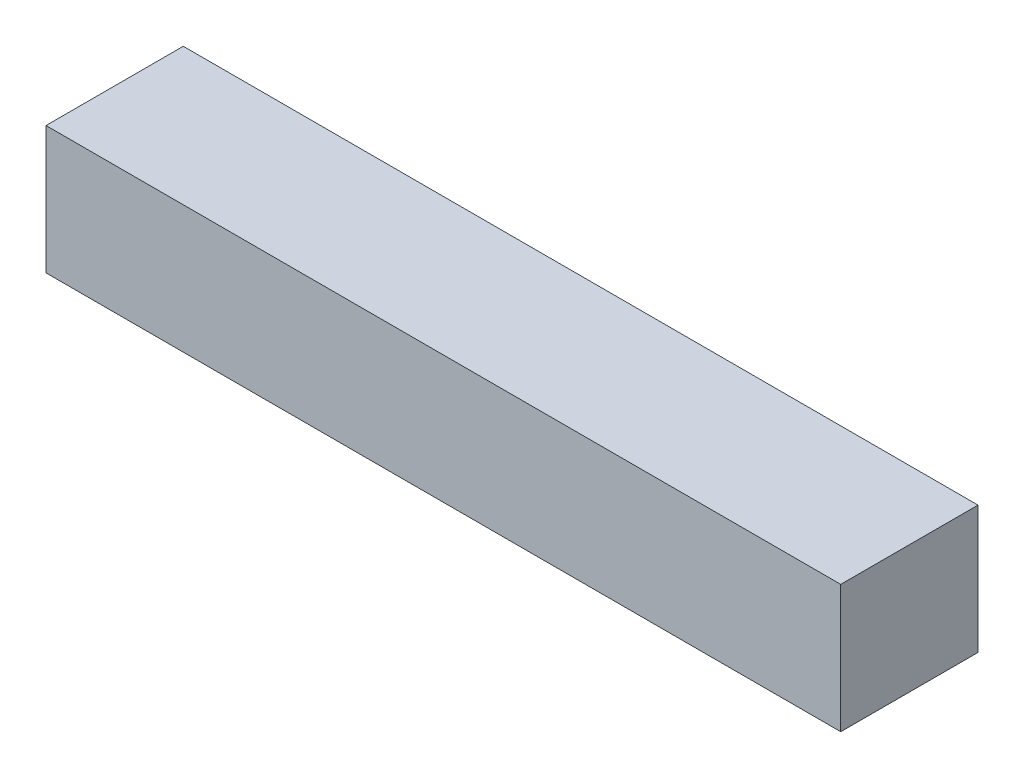
ISO-10303-21;
HEADER;
FILE_DESCRIPTION(('STEP AP214'),'2;1');
FILE_NAME('part.step','',(''),(''),'','','');
FILE_SCHEMA(('AUTOMOTIVE_DESIGN { 1 0 10303 214 1 1 1 1 }'));
ENDSEC;
DATA;
#1=APPLICATION_CONTEXT('core data for automotive mechanical design processes');
#2=APPLICATION_PROTOCOL_DEFINITION('international standard','automotive_design',2000,#1);
#3=PRODUCT_CONTEXT('',#1,'mechanical');
#4=PRODUCT('Part','Part','',(#3));
#5=PRODUCT_RELATED_PRODUCT_CATEGORY('part','',(#4));
#6=PRODUCT_DEFINITION_FORMATION('','',#4);
#7=PRODUCT_DEFINITION_CONTEXT('part definition',#1,'design');
#8=PRODUCT_DEFINITION('design','',#6,#7);
#9=PRODUCT_DEFINITION_SHAPE('','',#8);
#10=(LENGTH_UNIT() NAMED_UNIT(*) SI_UNIT(.MILLI.,.METRE.));
#11=(NAMED_UNIT(*) PLANE_ANGLE_UNIT() SI_UNIT($,.RADIAN.));
#12=(NAMED_UNIT(*) SI_UNIT($,.STERADIAN.) SOLID_ANGLE_UNIT());
#13=UNCERTAINTY_MEASURE_WITH_UNIT(LENGTH_MEASURE(1.E-05),#10,'distance_accuracy_value','');
#14=(GEOMETRIC_REPRESENTATION_CONTEXT(3) GLOBAL_UNCERTAINTY_ASSIGNED_CONTEXT((#13)) GLOBAL_UNIT_ASSIGNED_CONTEXT((#10,
#11,#12)) REPRESENTATION_CONTEXT('',''));
#15=CARTESIAN_POINT('',(0.,0.,0.));
#16=DIRECTION('',(0.,0.,1.));
#17=DIRECTION('',(1.,0.,0.));
#18=AXIS2_PLACEMENT_3D('',#15,#16,#17);
#19=CARTESIAN_POINT('',(0.,91.3860769958456,0.));
#20=DIRECTION('',(0.,-1.,0.));
#21=DIRECTION('',(0.,0.,-1.));
#22=AXIS2_PLACEMENT_3D('',#19,#20,#21);
#23=PLANE('',#22);
#24=DIRECTION('',(1.,0.,0.));
#25=VECTOR('',#24,1.);
#26=CARTESIAN_POINT('',(95.8753029989626,91.3860769958456,4.13284910660407));
#27=LINE('',#26,#25);
#28=CARTESIAN_POINT('',(40.8753029989626,91.3860769958456,4.13284910660407));
#29=VERTEX_POINT('',#28);
#30=CARTESIAN_POINT('',(95.8753029989626,91.3860769958456,4.13284910660407));
#31=VERTEX_POINT('',#30);
#32=EDGE_CURVE('E126',#29,#31,#27,.T.);
#33=ORIENTED_EDGE('',*,*,#32,.T.);
#34=DIRECTION('',(0.,0.,-1.));
#35=VECTOR('',#34,1.);
#36=CARTESIAN_POINT('',(95.8753029989626,91.3860769958456,-5.36715089339593));
#37=LINE('',#36,#35);
#38=CARTESIAN_POINT('',(95.8753029989626,91.3860769958456,-5.36715089339593));
#39=VERTEX_POINT('',#38);
#40=EDGE_CURVE('E54',#31,#39,#37,.T.);
#41=ORIENTED_EDGE('',*,*,#40,.T.);
#42=DIRECTION('',(1.,0.,0.));
#43=VECTOR('',#42,1.);
#44=CARTESIAN_POINT('',(-44.5413636677041,91.3860769958456,-5.36715089339593));
#45=LINE('',#44,#43);
#46=CARTESIAN_POINT('',(40.8753029989626,91.3860769958456,-5.36715089339593));
#47=VERTEX_POINT('',#46);
#48=EDGE_CURVE('E48',#47,#39,#45,.T.);
#49=ORIENTED_EDGE('',*,*,#48,.F.);
#50=DIRECTION('',(0.,0.,1.));
#51=VECTOR('',#50,1.);
#52=CARTESIAN_POINT('',(40.8753029989626,91.3860769958456,4.13284910660407));
#53=LINE('',#52,#51);
#54=EDGE_CURVE('E11',#47,#29,#53,.T.);
#55=ORIENTED_EDGE('',*,*,#54,.T.);
#56=EDGE_LOOP('',(#33,#41,#49,#55));
#57=FACE_BOUND('',#56,.T.);
#58=ADVANCED_FACE('F45',(#57),#23,.F.);
#59=CARTESIAN_POINT('',(-44.5413636677041,-63.2805896708211,-5.36715089339593));
#60=DIRECTION('',(0.,0.,1.));
#61=DIRECTION('',(1.,0.,0.));
#62=AXIS2_PLACEMENT_3D('',#59,#60,#61);
#63=PLANE('',#62);
#64=DIRECTION('',(0.,-1.,0.));
#65=VECTOR('',#64,1.);
#66=CARTESIAN_POINT('',(40.8753029989626,-63.2805896708211,-5.36715089339593));
#67=LINE('',#66,#65);
#68=CARTESIAN_POINT('',(40.8753029989626,82.5527436625122,-5.36715089339593));
#69=VERTEX_POINT('',#68);
#70=EDGE_CURVE('E109',#47,#69,#67,.T.);
#71=ORIENTED_EDGE('',*,*,#70,.F.);
#72=ORIENTED_EDGE('',*,*,#48,.T.);
#73=DIRECTION('',(0.,1.,0.));
#74=VECTOR('',#73,1.);
#75=CARTESIAN_POINT('',(95.8753029989626,-63.2805896708211,-5.36715089339593));
#76=LINE('',#75,#74);
#77=CARTESIAN_POINT('',(95.8753029989626,82.5527436625122,-5.36715089339593));
#78=VERTEX_POINT('',#77);
#79=EDGE_CURVE('E116',#78,#39,#76,.T.);
#80=ORIENTED_EDGE('',*,*,#79,.F.);
#81=DIRECTION('',(-1.,0.,0.));
#82=VECTOR('',#81,1.);
#83=CARTESIAN_POINT('',(-44.5413636677041,82.5527436625122,-5.36715089339593));
#84=LINE('',#83,#82);
#85=EDGE_CURVE('E104',#78,#69,#84,.T.);
#86=ORIENTED_EDGE('',*,*,#85,.T.);
#87=EDGE_LOOP('',(#71,#72,#80,#86));
#88=FACE_BOUND('',#87,.T.);
#89=ADVANCED_FACE('F114',(#88),#63,.F.);
#90=CARTESIAN_POINT('',(-44.5413636677041,82.5527436625122,1.4661824399374));
#91=DIRECTION('',(0.,1.,0.));
#92=DIRECTION('',(1.,0.,0.));
#93=AXIS2_PLACEMENT_3D('',#90,#91,#92);
#94=PLANE('',#93);
#95=DIRECTION('',(1.,0.,0.));
#96=VECTOR('',#95,1.);
#97=CARTESIAN_POINT('',(-44.5413636677041,82.5527436625122,4.13284910660407));
#98=LINE('',#97,#96);
#99=CARTESIAN_POINT('',(40.8753029989626,82.5527436625122,4.13284910660407));
#100=VERTEX_POINT('',#99);
#101=CARTESIAN_POINT('',(95.8753029989626,82.5527436625122,4.13284910660407));
#102=VERTEX_POINT('',#101);
#103=EDGE_CURVE('E105',#100,#102,#98,.T.);
#104=ORIENTED_EDGE('',*,*,#103,.F.);
#105=DIRECTION('',(0.,0.,1.));
#106=VECTOR('',#105,1.);
#107=CARTESIAN_POINT('',(40.8753029989626,82.5527436625122,-12.5338175600626));
#108=LINE('',#107,#106);
#109=EDGE_CURVE('E100',#69,#100,#108,.T.);
#110=ORIENTED_EDGE('',*,*,#109,.F.);
#111=ORIENTED_EDGE('',*,*,#85,.F.);
#112=DIRECTION('',(0.,0.,1.));
#113=VECTOR('',#112,1.);
#114=CARTESIAN_POINT('',(95.8753029989626,82.5527436625122,-12.5338175600626));
#115=LINE('',#114,#113);
#116=EDGE_CURVE('E132',#78,#102,#115,.T.);
#117=ORIENTED_EDGE('',*,*,#116,.T.);
#118=EDGE_LOOP('',(#104,#110,#111,#117));
#119=FACE_BOUND('',#118,.T.);
#120=ADVANCED_FACE('F101',(#119),#94,.F.);
#121=CARTESIAN_POINT('',(-44.5413636677041,-63.2805896708211,4.13284910660407));
#122=DIRECTION('',(0.,0.,1.));
#123=DIRECTION('',(1.,0.,0.));
#124=AXIS2_PLACEMENT_3D('',#121,#122,#123);
#125=PLANE('',#124);
#126=ORIENTED_EDGE('',*,*,#103,.T.);
#127=DIRECTION('',(0.,1.,0.));
#128=VECTOR('',#127,1.);
#129=CARTESIAN_POINT('',(95.8753029989626,-63.2805896708211,4.13284910660407));
#130=LINE('',#129,#128);
#131=EDGE_CURVE('E134',#102,#31,#130,.T.);
#132=ORIENTED_EDGE('',*,*,#131,.T.);
#133=ORIENTED_EDGE('',*,*,#32,.F.);
#134=DIRECTION('',(0.,-1.,0.));
#135=VECTOR('',#134,1.);
#136=CARTESIAN_POINT('',(40.8753029989626,-63.2805896708211,4.13284910660407));
#137=LINE('',#136,#135);
#138=EDGE_CURVE('E108',#29,#100,#137,.T.);
#139=ORIENTED_EDGE('',*,*,#138,.T.);
#140=EDGE_LOOP('',(#126,#132,#133,#139));
#141=FACE_BOUND('',#140,.T.);
#142=ADVANCED_FACE('F148',(#141),#125,.T.);
#143=CARTESIAN_POINT('',(95.8753029989626,-63.2805896708211,-2.0338175600626));
#144=DIRECTION('',(-1.,0.,0.));
#145=DIRECTION('',(0.,0.,1.));
#146=AXIS2_PLACEMENT_3D('',#143,#144,#145);
#147=PLANE('',#146);
#148=ORIENTED_EDGE('',*,*,#131,.F.);
#149=ORIENTED_EDGE('',*,*,#116,.F.);
#150=ORIENTED_EDGE('',*,*,#79,.T.);
#151=ORIENTED_EDGE('',*,*,#40,.F.);
#152=EDGE_LOOP('',(#148,#149,#150,#151));
#153=FACE_BOUND('',#152,.T.);
#154=ADVANCED_FACE('F150',(#153),#147,.F.);
#155=CARTESIAN_POINT('',(40.8753029989626,-63.2805896708211,-2.0338175600626));
#156=DIRECTION('',(1.,0.,0.));
#157=DIRECTION('',(0.,1.,0.));
#158=AXIS2_PLACEMENT_3D('',#155,#156,#157);
#159=PLANE('',#158);
#160=ORIENTED_EDGE('',*,*,#70,.T.);
#161=ORIENTED_EDGE('',*,*,#109,.T.);
#162=ORIENTED_EDGE('',*,*,#138,.F.);
#163=ORIENTED_EDGE('',*,*,#54,.F.);
#164=EDGE_LOOP('',(#160,#161,#162,#163));
#165=FACE_BOUND('',#164,.T.);
#166=ADVANCED_FACE('F111',(#165),#159,.F.);
#167=CLOSED_SHELL('',(#58,#89,#120,#142,#154,#166));
#168=MANIFOLD_SOLID_BREP('B2',#167);
#169=ADVANCED_BREP_SHAPE_REPRESENTATION('',(#18,#168),#14);
#170=SHAPE_DEFINITION_REPRESENTATION(#9,#169);
ENDSEC;
END-ISO-10303-21;
